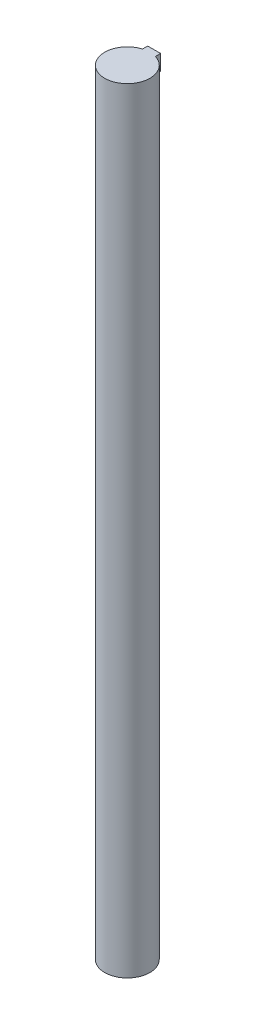
ISO-10303-21;
HEADER;
FILE_DESCRIPTION(('STEP AP214'),'2;1');
FILE_NAME('part.step','',(''),(''),'','','');
FILE_SCHEMA(('AUTOMOTIVE_DESIGN { 1 0 10303 214 1 1 1 1 }'));
ENDSEC;
DATA;
#1=APPLICATION_CONTEXT('core data for automotive mechanical design processes');
#2=APPLICATION_PROTOCOL_DEFINITION('international standard','automotive_design',2000,#1);
#3=PRODUCT_CONTEXT('',#1,'mechanical');
#4=PRODUCT('Part','Part','',(#3));
#5=PRODUCT_RELATED_PRODUCT_CATEGORY('part','',(#4));
#6=PRODUCT_DEFINITION_FORMATION('','',#4);
#7=PRODUCT_DEFINITION_CONTEXT('part definition',#1,'design');
#8=PRODUCT_DEFINITION('design','',#6,#7);
#9=PRODUCT_DEFINITION_SHAPE('','',#8);
#10=(LENGTH_UNIT() NAMED_UNIT(*) SI_UNIT(.MILLI.,.METRE.));
#11=(NAMED_UNIT(*) PLANE_ANGLE_UNIT() SI_UNIT($,.RADIAN.));
#12=(NAMED_UNIT(*) SI_UNIT($,.STERADIAN.) SOLID_ANGLE_UNIT());
#13=UNCERTAINTY_MEASURE_WITH_UNIT(LENGTH_MEASURE(1.E-05),#10,'distance_accuracy_value','');
#14=(GEOMETRIC_REPRESENTATION_CONTEXT(3) GLOBAL_UNCERTAINTY_ASSIGNED_CONTEXT((#13)) GLOBAL_UNIT_ASSIGNED_CONTEXT((#10,
#11,#12)) REPRESENTATION_CONTEXT('',''));
#15=CARTESIAN_POINT('',(0.,0.,0.));
#16=DIRECTION('',(0.,0.,1.));
#17=DIRECTION('',(1.,0.,0.));
#18=AXIS2_PLACEMENT_3D('',#15,#16,#17);
#19=CARTESIAN_POINT('',(0.,600.,0.));
#20=DIRECTION('',(0.,-1.,0.));
#21=DIRECTION('',(0.,0.,-1.));
#22=AXIS2_PLACEMENT_3D('',#19,#20,#21);
#23=CYLINDRICAL_SURFACE('',#22,17.5);
#24=CARTESIAN_POINT('',(0.,588.,0.));
#25=DIRECTION('',(0.,-1.,0.));
#26=DIRECTION('',(0.,0.,-1.));
#27=AXIS2_PLACEMENT_3D('',#24,#25,#26);
#28=CIRCLE('',#27,17.5);
#29=CARTESIAN_POINT('',(-5.,588.,-16.77051));
#30=VERTEX_POINT('',#29);
#31=CARTESIAN_POINT('',(5.,588.,-16.77051));
#32=VERTEX_POINT('',#31);
#33=EDGE_CURVE('E11',#30,#32,#28,.T.);
#34=ORIENTED_EDGE('',*,*,#33,.T.);
#35=DIRECTION('',(0.,1.,0.));
#36=VECTOR('',#35,1.);
#37=CARTESIAN_POINT('',(5.,588.,-16.77051));
#38=LINE('',#37,#36);
#39=CARTESIAN_POINT('',(5.,600.,-16.77051));
#40=VERTEX_POINT('',#39);
#41=EDGE_CURVE('E60',#32,#40,#38,.T.);
#42=ORIENTED_EDGE('',*,*,#41,.T.);
#43=CARTESIAN_POINT('',(0.,600.,0.));
#44=DIRECTION('',(0.,1.,0.));
#45=DIRECTION('',(0.,0.,1.));
#46=AXIS2_PLACEMENT_3D('',#43,#44,#45);
#47=CIRCLE('',#46,17.5);
#48=CARTESIAN_POINT('',(-5.,600.,-16.7705098312484));
#49=VERTEX_POINT('',#48);
#50=EDGE_CURVE('E44',#49,#40,#47,.T.);
#51=ORIENTED_EDGE('',*,*,#50,.F.);
#52=DIRECTION('',(0.,1.,0.));
#53=VECTOR('',#52,1.);
#54=CARTESIAN_POINT('',(-5.,588.,-16.77051));
#55=LINE('',#54,#53);
#56=EDGE_CURVE('E91',#30,#49,#55,.T.);
#57=ORIENTED_EDGE('',*,*,#56,.F.);
#58=EDGE_LOOP('',(#34,#42,#51,#57));
#59=FACE_BOUND('',#58,.T.);
#60=CARTESIAN_POINT('',(0.,0.,0.));
#61=DIRECTION('',(0.,1.,0.));
#62=DIRECTION('',(0.,0.,1.));
#63=AXIS2_PLACEMENT_3D('',#60,#61,#62);
#64=CIRCLE('',#63,17.5);
#65=CARTESIAN_POINT('',(0.,0.,17.5));
#66=VERTEX_POINT('',#65);
#67=EDGE_CURVE('E107',#66,#66,#64,.T.);
#68=ORIENTED_EDGE('',*,*,#67,.T.);
#69=EDGE_LOOP('',(#68));
#70=FACE_BOUND('',#69,.T.);
#71=ADVANCED_FACE('F37',(#59,#70),#23,.T.);
#72=CARTESIAN_POINT('',(0.,600.,0.));
#73=DIRECTION('',(0.,1.,0.));
#74=DIRECTION('',(0.,0.,1.));
#75=AXIS2_PLACEMENT_3D('',#72,#73,#74);
#76=PLANE('',#75);
#77=ORIENTED_EDGE('',*,*,#50,.T.);
#78=DIRECTION('',(0.,0.,-1.));
#79=VECTOR('',#78,1.);
#80=CARTESIAN_POINT('',(5.,600.,-16.77051));
#81=LINE('',#80,#79);
#82=CARTESIAN_POINT('',(5.,600.,-20.80051));
#83=VERTEX_POINT('',#82);
#84=EDGE_CURVE('E75',#40,#83,#81,.T.);
#85=ORIENTED_EDGE('',*,*,#84,.T.);
#86=DIRECTION('',(-1.,0.,0.));
#87=VECTOR('',#86,1.);
#88=CARTESIAN_POINT('',(-5.,600.,-20.80051));
#89=LINE('',#88,#87);
#90=CARTESIAN_POINT('',(-5.,600.,-20.80051));
#91=VERTEX_POINT('',#90);
#92=EDGE_CURVE('E103',#83,#91,#89,.T.);
#93=ORIENTED_EDGE('',*,*,#92,.T.);
#94=DIRECTION('',(0.,0.,1.));
#95=VECTOR('',#94,1.);
#96=CARTESIAN_POINT('',(-5.,600.,-16.77051));
#97=LINE('',#96,#95);
#98=EDGE_CURVE('E51',#91,#49,#97,.T.);
#99=ORIENTED_EDGE('',*,*,#98,.T.);
#100=EDGE_LOOP('',(#77,#85,#93,#99));
#101=FACE_BOUND('',#100,.T.);
#102=ADVANCED_FACE('F117',(#101),#76,.T.);
#103=CARTESIAN_POINT('',(0.,0.,0.));
#104=DIRECTION('',(0.,1.,0.));
#105=DIRECTION('',(0.,0.,1.));
#106=AXIS2_PLACEMENT_3D('',#103,#104,#105);
#107=PLANE('',#106);
#108=ORIENTED_EDGE('',*,*,#67,.F.);
#109=EDGE_LOOP('',(#108));
#110=FACE_BOUND('',#109,.T.);
#111=ADVANCED_FACE('F114',(#110),#107,.F.);
#112=CARTESIAN_POINT('',(5.,588.,-16.77051));
#113=DIRECTION('',(1.,0.,0.));
#114=DIRECTION('',(0.,0.,-1.));
#115=AXIS2_PLACEMENT_3D('',#112,#113,#114);
#116=PLANE('',#115);
#117=ORIENTED_EDGE('',*,*,#84,.F.);
#118=ORIENTED_EDGE('',*,*,#41,.F.);
#119=DIRECTION('',(0.,0.,-1.));
#120=VECTOR('',#119,1.);
#121=CARTESIAN_POINT('',(5.,588.,-16.77051));
#122=LINE('',#121,#120);
#123=CARTESIAN_POINT('',(5.,588.,-20.80051));
#124=VERTEX_POINT('',#123);
#125=EDGE_CURVE('E98',#32,#124,#122,.T.);
#126=ORIENTED_EDGE('',*,*,#125,.T.);
#127=DIRECTION('',(0.,1.,0.));
#128=VECTOR('',#127,1.);
#129=CARTESIAN_POINT('',(5.,588.,-20.80051));
#130=LINE('',#129,#128);
#131=EDGE_CURVE('E81',#124,#83,#130,.T.);
#132=ORIENTED_EDGE('',*,*,#131,.T.);
#133=EDGE_LOOP('',(#117,#118,#126,#132));
#134=FACE_BOUND('',#133,.T.);
#135=ADVANCED_FACE('F116',(#134),#116,.T.);
#136=CARTESIAN_POINT('',(-5.,588.,-16.77051));
#137=DIRECTION('',(-1.,0.,0.));
#138=DIRECTION('',(0.,0.,1.));
#139=AXIS2_PLACEMENT_3D('',#136,#137,#138);
#140=PLANE('',#139);
#141=ORIENTED_EDGE('',*,*,#98,.F.);
#142=DIRECTION('',(0.,1.,0.));
#143=VECTOR('',#142,1.);
#144=CARTESIAN_POINT('',(-5.,588.,-20.80051));
#145=LINE('',#144,#143);
#146=CARTESIAN_POINT('',(-5.,588.,-20.80051));
#147=VERTEX_POINT('',#146);
#148=EDGE_CURVE('E86',#147,#91,#145,.T.);
#149=ORIENTED_EDGE('',*,*,#148,.F.);
#150=DIRECTION('',(0.,0.,1.));
#151=VECTOR('',#150,1.);
#152=CARTESIAN_POINT('',(-5.,588.,-16.77051));
#153=LINE('',#152,#151);
#154=EDGE_CURVE('E89',#147,#30,#153,.T.);
#155=ORIENTED_EDGE('',*,*,#154,.T.);
#156=ORIENTED_EDGE('',*,*,#56,.T.);
#157=EDGE_LOOP('',(#141,#149,#155,#156));
#158=FACE_BOUND('',#157,.T.);
#159=ADVANCED_FACE('F88',(#158),#140,.T.);
#160=CARTESIAN_POINT('',(-5.,588.,-20.80051));
#161=DIRECTION('',(0.,0.,-1.));
#162=DIRECTION('',(-1.,0.,0.));
#163=AXIS2_PLACEMENT_3D('',#160,#161,#162);
#164=PLANE('',#163);
#165=ORIENTED_EDGE('',*,*,#92,.F.);
#166=ORIENTED_EDGE('',*,*,#131,.F.);
#167=DIRECTION('',(-1.,0.,0.));
#168=VECTOR('',#167,1.);
#169=CARTESIAN_POINT('',(-5.,588.,-20.80051));
#170=LINE('',#169,#168);
#171=EDGE_CURVE('E95',#124,#147,#170,.T.);
#172=ORIENTED_EDGE('',*,*,#171,.T.);
#173=ORIENTED_EDGE('',*,*,#148,.T.);
#174=EDGE_LOOP('',(#165,#166,#172,#173));
#175=FACE_BOUND('',#174,.T.);
#176=ADVANCED_FACE('F97',(#175),#164,.T.);
#177=CARTESIAN_POINT('',(0.,588.,0.));
#178=DIRECTION('',(0.,-1.,0.));
#179=DIRECTION('',(0.,0.,-1.));
#180=AXIS2_PLACEMENT_3D('',#177,#178,#179);
#181=PLANE('',#180);
#182=ORIENTED_EDGE('',*,*,#33,.F.);
#183=ORIENTED_EDGE('',*,*,#154,.F.);
#184=ORIENTED_EDGE('',*,*,#171,.F.);
#185=ORIENTED_EDGE('',*,*,#125,.F.);
#186=EDGE_LOOP('',(#182,#183,#184,#185));
#187=FACE_BOUND('',#186,.T.);
#188=ADVANCED_FACE('F94',(#187),#181,.T.);
#189=CLOSED_SHELL('',(#71,#102,#111,#135,#159,#176,#188));
#190=MANIFOLD_SOLID_BREP('B2',#189);
#191=ADVANCED_BREP_SHAPE_REPRESENTATION('',(#18,#190),#14);
#192=SHAPE_DEFINITION_REPRESENTATION(#9,#191);
ENDSEC;
END-ISO-10303-21;
